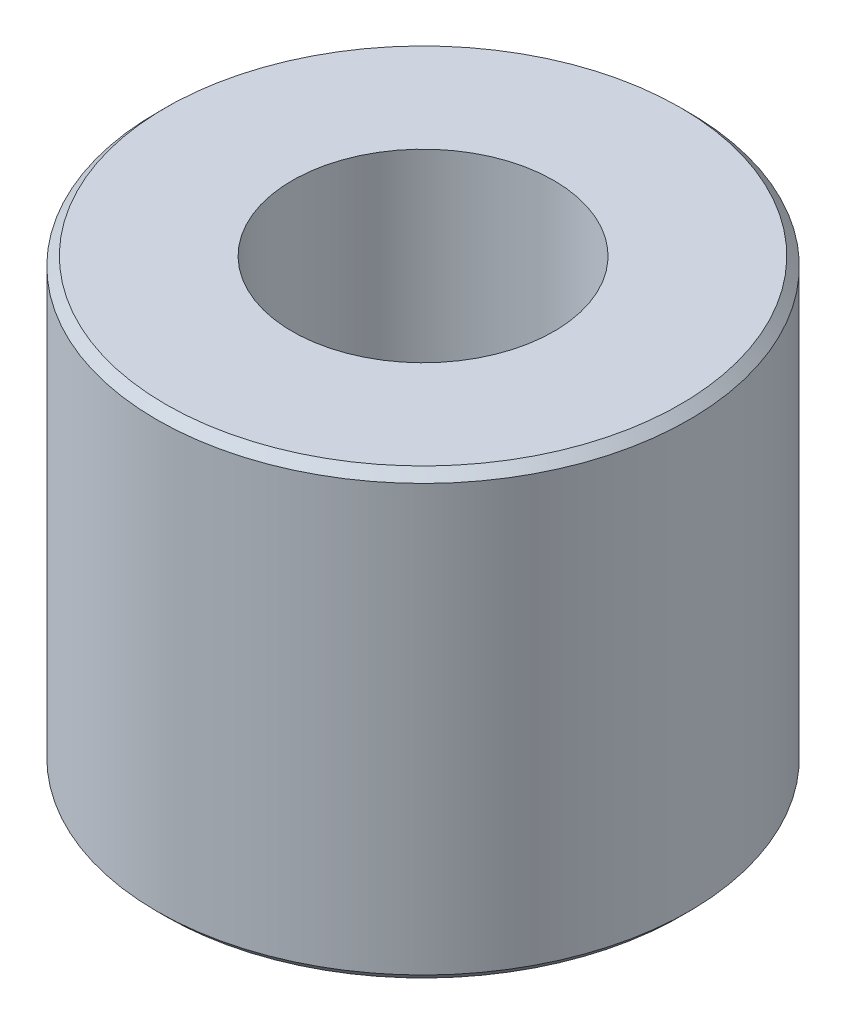
ISO-10303-21;
HEADER;
FILE_DESCRIPTION(('STEP AP214'),'2;1');
FILE_NAME('part.step','',(''),(''),'','','');
FILE_SCHEMA(('AUTOMOTIVE_DESIGN { 1 0 10303 214 1 1 1 1 }'));
ENDSEC;
DATA;
#1=APPLICATION_CONTEXT('core data for automotive mechanical design processes');
#2=APPLICATION_PROTOCOL_DEFINITION('international standard','automotive_design',2000,#1);
#3=PRODUCT_CONTEXT('',#1,'mechanical');
#4=PRODUCT('Part','Part','',(#3));
#5=PRODUCT_RELATED_PRODUCT_CATEGORY('part','',(#4));
#6=PRODUCT_DEFINITION_FORMATION('','',#4);
#7=PRODUCT_DEFINITION_CONTEXT('part definition',#1,'design');
#8=PRODUCT_DEFINITION('design','',#6,#7);
#9=PRODUCT_DEFINITION_SHAPE('','',#8);
#10=(LENGTH_UNIT() NAMED_UNIT(*) SI_UNIT(.MILLI.,.METRE.));
#11=(NAMED_UNIT(*) PLANE_ANGLE_UNIT() SI_UNIT($,.RADIAN.));
#12=(NAMED_UNIT(*) SI_UNIT($,.STERADIAN.) SOLID_ANGLE_UNIT());
#13=UNCERTAINTY_MEASURE_WITH_UNIT(LENGTH_MEASURE(1.E-05),#10,'distance_accuracy_value','');
#14=(GEOMETRIC_REPRESENTATION_CONTEXT(3) GLOBAL_UNCERTAINTY_ASSIGNED_CONTEXT((#13)) GLOBAL_UNIT_ASSIGNED_CONTEXT((#10,
#11,#12)) REPRESENTATION_CONTEXT('',''));
#15=CARTESIAN_POINT('',(0.,0.,0.));
#16=DIRECTION('',(0.,0.,1.));
#17=DIRECTION('',(1.,0.,0.));
#18=AXIS2_PLACEMENT_3D('',#15,#16,#17);
#19=CARTESIAN_POINT('',(0.,57.7500232056,0.));
#20=DIRECTION('',(0.,-1.,0.));
#21=DIRECTION('',(0.,0.,-1.));
#22=AXIS2_PLACEMENT_3D('',#19,#20,#21);
#23=CYLINDRICAL_SURFACE('',#22,14.75);
#24=CARTESIAN_POINT('',(0.,50.,0.));
#25=DIRECTION('',(0.,-1.,0.));
#26=DIRECTION('',(0.,0.,-1.));
#27=AXIS2_PLACEMENT_3D('',#24,#25,#26);
#28=CIRCLE('',#27,14.75);
#29=CARTESIAN_POINT('',(0.,50.,-14.75));
#30=VERTEX_POINT('',#29);
#31=EDGE_CURVE('P0_E34',#30,#30,#28,.T.);
#32=ORIENTED_EDGE('',*,*,#31,.F.);
#33=EDGE_LOOP('',(#32));
#34=FACE_BOUND('',#33,.T.);
#35=CARTESIAN_POINT('',(0.,0.,0.));
#36=DIRECTION('',(0.,-1.,0.));
#37=DIRECTION('',(0.,0.,-1.));
#38=AXIS2_PLACEMENT_3D('',#35,#36,#37);
#39=CIRCLE('',#38,14.75);
#40=CARTESIAN_POINT('',(0.,0.,-14.75));
#41=VERTEX_POINT('',#40);
#42=EDGE_CURVE('P0_E18',#41,#41,#39,.T.);
#43=ORIENTED_EDGE('',*,*,#42,.T.);
#44=EDGE_LOOP('',(#43));
#45=FACE_BOUND('',#44,.T.);
#46=ADVANCED_FACE('P0_F15',(#34,#45),#23,.F.);
#47=CARTESIAN_POINT('',(0.,0.,0.));
#48=DIRECTION('',(0.,1.,0.));
#49=DIRECTION('',(0.,0.,1.));
#50=AXIS2_PLACEMENT_3D('',#47,#48,#49);
#51=PLANE('',#50);
#52=ORIENTED_EDGE('',*,*,#42,.F.);
#53=EDGE_LOOP('',(#52));
#54=FACE_BOUND('',#53,.T.);
#55=CARTESIAN_POINT('',(0.,0.,0.));
#56=DIRECTION('',(0.,1.,0.));
#57=DIRECTION('',(0.,0.,1.));
#58=AXIS2_PLACEMENT_3D('',#55,#56,#57);
#59=CIRCLE('',#58,28.9999947346989);
#60=CARTESIAN_POINT('',(0.,0.,28.9999947346989));
#61=VERTEX_POINT('',#60);
#62=EDGE_CURVE('P0_E32',#61,#61,#59,.T.);
#63=ORIENTED_EDGE('',*,*,#62,.F.);
#64=EDGE_LOOP('',(#63));
#65=FACE_BOUND('',#64,.T.);
#66=ADVANCED_FACE('P0_F42',(#54,#65),#51,.F.);
#67=CARTESIAN_POINT('',(0.,50.,0.));
#68=DIRECTION('',(0.,1.,0.));
#69=DIRECTION('',(0.,0.,1.));
#70=AXIS2_PLACEMENT_3D('',#67,#68,#69);
#71=PLANE('',#70);
#72=ORIENTED_EDGE('',*,*,#31,.T.);
#73=EDGE_LOOP('',(#72));
#74=FACE_BOUND('',#73,.T.);
#75=CARTESIAN_POINT('',(0.,50.,0.));
#76=DIRECTION('',(0.,1.,0.));
#77=DIRECTION('',(0.,0.,1.));
#78=AXIS2_PLACEMENT_3D('',#75,#76,#77);
#79=CIRCLE('',#78,28.9999947347188);
#80=CARTESIAN_POINT('',(0.,50.,28.9999947347188));
#81=VERTEX_POINT('',#80);
#82=EDGE_CURVE('P0_E27',#81,#81,#79,.F.);
#83=ORIENTED_EDGE('',*,*,#82,.F.);
#84=EDGE_LOOP('',(#83));
#85=FACE_BOUND('',#84,.T.);
#86=ADVANCED_FACE('P0_F45',(#74,#85),#71,.T.);
#87=CARTESIAN_POINT('',(0.,1.00000272317719,0.));
#88=DIRECTION('',(0.,1.,0.));
#89=DIRECTION('',(0.,0.,1.));
#90=AXIS2_PLACEMENT_3D('',#87,#88,#89);
#91=CONICAL_SURFACE('',#90,29.9999972763128,0.785398072616002);
#92=CARTESIAN_POINT('',(0.,1.,0.));
#93=DIRECTION('',(0.,1.,0.));
#94=DIRECTION('',(0.,0.,1.));
#95=AXIS2_PLACEMENT_3D('',#92,#93,#94);
#96=CIRCLE('',#95,30.);
#97=CARTESIAN_POINT('',(0.,1.,30.));
#98=VERTEX_POINT('',#97);
#99=EDGE_CURVE('P0_E22',#98,#98,#96,.T.);
#100=ORIENTED_EDGE('',*,*,#99,.F.);
#101=EDGE_LOOP('',(#100));
#102=FACE_BOUND('',#101,.T.);
#103=ORIENTED_EDGE('',*,*,#62,.T.);
#104=EDGE_LOOP('',(#103));
#105=FACE_BOUND('',#104,.T.);
#106=ADVANCED_FACE('P0_F48',(#102,#105),#91,.T.);
#107=CARTESIAN_POINT('',(0.,48.9999972765779,0.));
#108=DIRECTION('',(0.,-1.,0.));
#109=DIRECTION('',(0.,0.,-1.));
#110=AXIS2_PLACEMENT_3D('',#107,#108,#109);
#111=CONICAL_SURFACE('',#110,29.9999972765774,0.785398072616);
#112=CARTESIAN_POINT('',(0.,49.,0.));
#113=DIRECTION('',(0.,1.,0.));
#114=DIRECTION('',(0.,0.,1.));
#115=AXIS2_PLACEMENT_3D('',#112,#113,#114);
#116=CIRCLE('',#115,30.);
#117=CARTESIAN_POINT('',(0.,49.,30.));
#118=VERTEX_POINT('',#117);
#119=EDGE_CURVE('P0_E10',#118,#118,#116,.F.);
#120=ORIENTED_EDGE('',*,*,#119,.F.);
#121=EDGE_LOOP('',(#120));
#122=FACE_BOUND('',#121,.T.);
#123=ORIENTED_EDGE('',*,*,#82,.T.);
#124=EDGE_LOOP('',(#123));
#125=FACE_BOUND('',#124,.T.);
#126=ADVANCED_FACE('P0_F50',(#122,#125),#111,.T.);
#127=CARTESIAN_POINT('',(0.,0.,0.));
#128=DIRECTION('',(0.,1.,0.));
#129=DIRECTION('',(0.,0.,1.));
#130=AXIS2_PLACEMENT_3D('',#127,#128,#129);
#131=CYLINDRICAL_SURFACE('',#130,30.);
#132=ORIENTED_EDGE('',*,*,#99,.T.);
#133=EDGE_LOOP('',(#132));
#134=FACE_BOUND('',#133,.T.);
#135=ORIENTED_EDGE('',*,*,#119,.T.);
#136=EDGE_LOOP('',(#135));
#137=FACE_BOUND('',#136,.T.);
#138=ADVANCED_FACE('P0_F58',(#134,#137),#131,.T.);
#139=CLOSED_SHELL('',(#46,#66,#86,#106,#126,#138));
#140=MANIFOLD_SOLID_BREP('P0_B1',#139);
#141=CARTESIAN_POINT('',(0.,57.7500232056,0.));
#142=DIRECTION('',(0.,-1.,0.));
#143=DIRECTION('',(0.,0.,-1.));
#144=AXIS2_PLACEMENT_3D('',#141,#142,#143);
#145=CYLINDRICAL_SURFACE('',#144,16.5);
#146=CARTESIAN_POINT('',(0.,50.,0.));
#147=DIRECTION('',(0.,-1.,0.));
#148=DIRECTION('',(0.,0.,-1.));
#149=AXIS2_PLACEMENT_3D('',#146,#147,#148);
#150=CIRCLE('',#149,16.5);
#151=CARTESIAN_POINT('',(0.,50.,-16.5));
#152=VERTEX_POINT('',#151);
#153=EDGE_CURVE('P1_E10',#152,#152,#150,.T.);
#154=ORIENTED_EDGE('',*,*,#153,.T.);
#155=EDGE_LOOP('',(#154));
#156=FACE_BOUND('',#155,.T.);
#157=CARTESIAN_POINT('',(0.,0.,0.));
#158=DIRECTION('',(0.,-1.,0.));
#159=DIRECTION('',(0.,0.,-1.));
#160=AXIS2_PLACEMENT_3D('',#157,#158,#159);
#161=CIRCLE('',#160,16.5);
#162=CARTESIAN_POINT('',(0.,0.,-16.5));
#163=VERTEX_POINT('',#162);
#164=EDGE_CURVE('P1_E16',#163,#163,#161,.F.);
#165=ORIENTED_EDGE('',*,*,#164,.T.);
#166=EDGE_LOOP('',(#165));
#167=FACE_BOUND('',#166,.T.);
#168=ADVANCED_FACE('P1_F15',(#156,#167),#145,.T.);
#169=OPEN_SHELL('',(#168));
#170=SHELL_BASED_SURFACE_MODEL('P1_B1',(#169));
#171=ADVANCED_BREP_SHAPE_REPRESENTATION('',(#18,#140),#14);
#172=MANIFOLD_SURFACE_SHAPE_REPRESENTATION('',(#18,#170),#14);
#173=SHAPE_REPRESENTATION('',(#18),#14);
#174=SHAPE_DEFINITION_REPRESENTATION(#9,#173);
#175=SHAPE_REPRESENTATION_RELATIONSHIP('','',#173,#171);
#176=SHAPE_REPRESENTATION_RELATIONSHIP('','',#173,#172);
ENDSEC;
END-ISO-10303-21;
